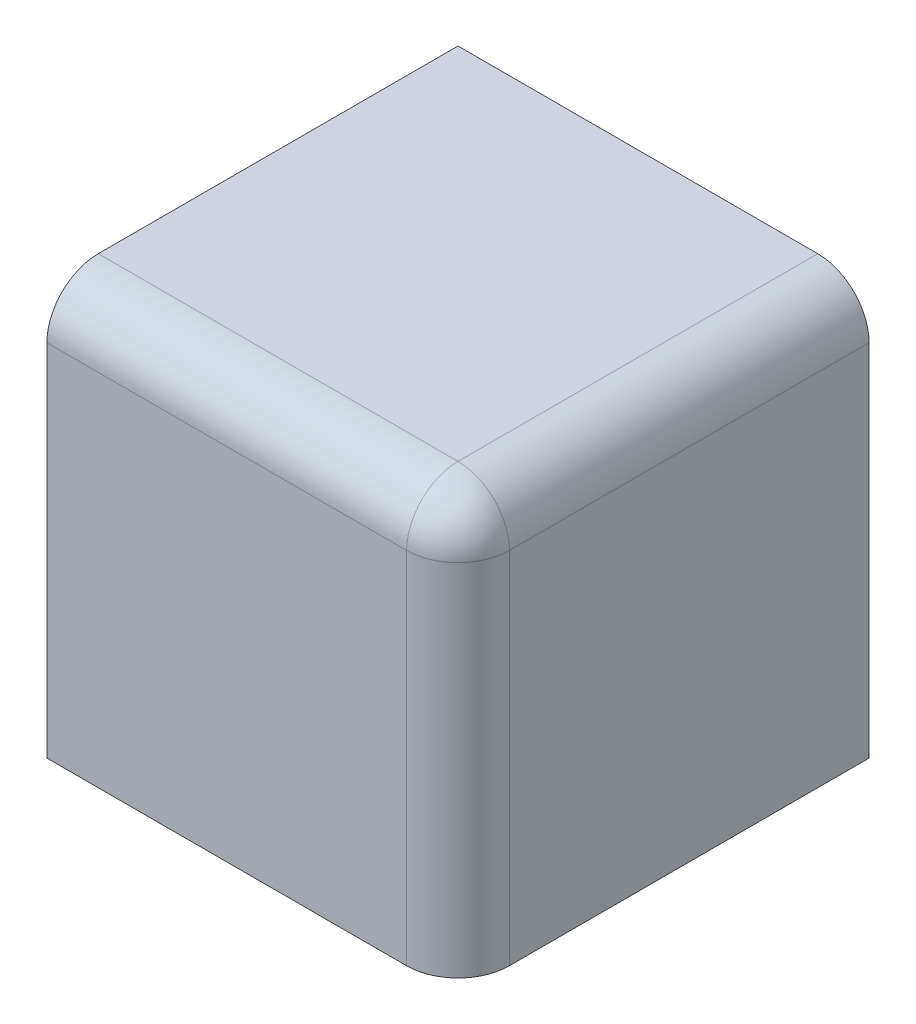
ISO-10303-21;
HEADER;
FILE_DESCRIPTION(('STEP AP214'),'2;1');
FILE_NAME('part.step','',(''),(''),'','','');
FILE_SCHEMA(('AUTOMOTIVE_DESIGN { 1 0 10303 214 1 1 1 1 }'));
ENDSEC;
DATA;
#1=APPLICATION_CONTEXT('core data for automotive mechanical design processes');
#2=APPLICATION_PROTOCOL_DEFINITION('international standard','automotive_design',2000,#1);
#3=PRODUCT_CONTEXT('',#1,'mechanical');
#4=PRODUCT('Part','Part','',(#3));
#5=PRODUCT_RELATED_PRODUCT_CATEGORY('part','',(#4));
#6=PRODUCT_DEFINITION_FORMATION('','',#4);
#7=PRODUCT_DEFINITION_CONTEXT('part definition',#1,'design');
#8=PRODUCT_DEFINITION('design','',#6,#7);
#9=PRODUCT_DEFINITION_SHAPE('','',#8);
#10=(LENGTH_UNIT() NAMED_UNIT(*) SI_UNIT(.MILLI.,.METRE.));
#11=(NAMED_UNIT(*) PLANE_ANGLE_UNIT() SI_UNIT($,.RADIAN.));
#12=(NAMED_UNIT(*) SI_UNIT($,.STERADIAN.) SOLID_ANGLE_UNIT());
#13=UNCERTAINTY_MEASURE_WITH_UNIT(LENGTH_MEASURE(1.E-05),#10,'distance_accuracy_value','');
#14=(GEOMETRIC_REPRESENTATION_CONTEXT(3) GLOBAL_UNCERTAINTY_ASSIGNED_CONTEXT((#13)) GLOBAL_UNIT_ASSIGNED_CONTEXT((#10,
#11,#12)) REPRESENTATION_CONTEXT('',''));
#15=CARTESIAN_POINT('',(0.,0.,0.));
#16=DIRECTION('',(0.,0.,1.));
#17=DIRECTION('',(1.,0.,0.));
#18=AXIS2_PLACEMENT_3D('',#15,#16,#17);
#19=CARTESIAN_POINT('',(0.,0.,20.));
#20=DIRECTION('',(0.,0.,1.));
#21=DIRECTION('',(1.,0.,0.));
#22=AXIS2_PLACEMENT_3D('',#19,#20,#21);
#23=PLANE('',#22);
#24=DIRECTION('',(0.,1.,0.));
#25=VECTOR('',#24,1.);
#26=CARTESIAN_POINT('',(17.5,0.,20.));
#27=LINE('',#26,#25);
#28=CARTESIAN_POINT('',(17.5,0.,20.));
#29=VERTEX_POINT('',#28);
#30=CARTESIAN_POINT('',(17.5,17.5,20.));
#31=VERTEX_POINT('',#30);
#32=EDGE_CURVE('E49',#29,#31,#27,.T.);
#33=ORIENTED_EDGE('',*,*,#32,.T.);
#34=DIRECTION('',(1.,0.,0.));
#35=VECTOR('',#34,1.);
#36=CARTESIAN_POINT('',(0.,17.5,20.));
#37=LINE('',#36,#35);
#38=CARTESIAN_POINT('',(0.,17.5,20.));
#39=VERTEX_POINT('',#38);
#40=EDGE_CURVE('E165',#31,#39,#37,.F.);
#41=ORIENTED_EDGE('',*,*,#40,.T.);
#42=DIRECTION('',(0.,1.,0.));
#43=VECTOR('',#42,1.);
#44=CARTESIAN_POINT('',(0.,0.,20.));
#45=LINE('',#44,#43);
#46=CARTESIAN_POINT('',(0.,0.,20.));
#47=VERTEX_POINT('',#46);
#48=EDGE_CURVE('E149',#47,#39,#45,.T.);
#49=ORIENTED_EDGE('',*,*,#48,.F.);
#50=DIRECTION('',(1.,0.,0.));
#51=VECTOR('',#50,1.);
#52=CARTESIAN_POINT('',(0.,0.,20.));
#53=LINE('',#52,#51);
#54=EDGE_CURVE('E131',#47,#29,#53,.T.);
#55=ORIENTED_EDGE('',*,*,#54,.T.);
#56=EDGE_LOOP('',(#33,#41,#49,#55));
#57=FACE_BOUND('',#56,.T.);
#58=ADVANCED_FACE('F32',(#57),#23,.T.);
#59=CARTESIAN_POINT('',(0.,0.,0.));
#60=DIRECTION('',(-1.,0.,0.));
#61=DIRECTION('',(0.,0.,1.));
#62=AXIS2_PLACEMENT_3D('',#59,#60,#61);
#63=PLANE('',#62);
#64=ORIENTED_EDGE('',*,*,#48,.T.);
#65=CARTESIAN_POINT('',(0.,17.5,17.5));
#66=DIRECTION('',(-1.,0.,0.));
#67=DIRECTION('',(0.,0.,1.));
#68=AXIS2_PLACEMENT_3D('',#65,#66,#67);
#69=CIRCLE('',#68,2.5);
#70=CARTESIAN_POINT('',(0.,20.,17.5));
#71=VERTEX_POINT('',#70);
#72=EDGE_CURVE('E41',#39,#71,#69,.T.);
#73=ORIENTED_EDGE('',*,*,#72,.T.);
#74=DIRECTION('',(0.,0.,1.));
#75=VECTOR('',#74,1.);
#76=CARTESIAN_POINT('',(0.,20.,0.));
#77=LINE('',#76,#75);
#78=CARTESIAN_POINT('',(0.,20.,0.));
#79=VERTEX_POINT('',#78);
#80=EDGE_CURVE('E145',#79,#71,#77,.T.);
#81=ORIENTED_EDGE('',*,*,#80,.F.);
#82=DIRECTION('',(0.,1.,0.));
#83=VECTOR('',#82,1.);
#84=CARTESIAN_POINT('',(0.,0.,0.));
#85=LINE('',#84,#83);
#86=CARTESIAN_POINT('',(0.,17.5,0.));
#87=VERTEX_POINT('',#86);
#88=EDGE_CURVE('E136',#87,#79,#85,.T.);
#89=ORIENTED_EDGE('',*,*,#88,.F.);
#90=DIRECTION('',(0.,0.,-1.));
#91=VECTOR('',#90,1.);
#92=CARTESIAN_POINT('',(0.,17.5,17.5));
#93=LINE('',#92,#91);
#94=CARTESIAN_POINT('',(0.,17.5,17.5));
#95=VERTEX_POINT('',#94);
#96=EDGE_CURVE('E127',#95,#87,#93,.T.);
#97=ORIENTED_EDGE('',*,*,#96,.F.);
#98=DIRECTION('',(0.,1.,0.));
#99=VECTOR('',#98,1.);
#100=CARTESIAN_POINT('',(0.,0.,17.5));
#101=LINE('',#100,#99);
#102=CARTESIAN_POINT('',(0.,0.,17.5));
#103=VERTEX_POINT('',#102);
#104=EDGE_CURVE('E112',#103,#95,#101,.T.);
#105=ORIENTED_EDGE('',*,*,#104,.F.);
#106=DIRECTION('',(0.,0.,1.));
#107=VECTOR('',#106,1.);
#108=CARTESIAN_POINT('',(0.,0.,0.));
#109=LINE('',#108,#107);
#110=EDGE_CURVE('E124',#103,#47,#109,.T.);
#111=ORIENTED_EDGE('',*,*,#110,.T.);
#112=EDGE_LOOP('',(#64,#73,#81,#89,#97,#105,#111));
#113=FACE_BOUND('',#112,.T.);
#114=ADVANCED_FACE('F123',(#113),#63,.T.);
#115=CARTESIAN_POINT('',(20.,0.,0.));
#116=DIRECTION('',(0.,0.,-1.));
#117=DIRECTION('',(-1.,0.,0.));
#118=AXIS2_PLACEMENT_3D('',#115,#116,#117);
#119=PLANE('',#118);
#120=DIRECTION('',(-1.,0.,0.));
#121=VECTOR('',#120,1.);
#122=CARTESIAN_POINT('',(20.,20.,0.));
#123=LINE('',#122,#121);
#124=CARTESIAN_POINT('',(17.5,20.,0.));
#125=VERTEX_POINT('',#124);
#126=EDGE_CURVE('E143',#125,#79,#123,.T.);
#127=ORIENTED_EDGE('',*,*,#126,.F.);
#128=CARTESIAN_POINT('',(17.5,17.5,0.));
#129=DIRECTION('',(0.,0.,-1.));
#130=DIRECTION('',(-1.,0.,0.));
#131=AXIS2_PLACEMENT_3D('',#128,#129,#130);
#132=CIRCLE('',#131,2.5);
#133=CARTESIAN_POINT('',(20.,17.5,0.));
#134=VERTEX_POINT('',#133);
#135=EDGE_CURVE('E158',#125,#134,#132,.T.);
#136=ORIENTED_EDGE('',*,*,#135,.T.);
#137=DIRECTION('',(0.,1.,0.));
#138=VECTOR('',#137,1.);
#139=CARTESIAN_POINT('',(20.,0.,0.));
#140=LINE('',#139,#138);
#141=CARTESIAN_POINT('',(20.,0.,0.));
#142=VERTEX_POINT('',#141);
#143=EDGE_CURVE('E132',#142,#134,#140,.T.);
#144=ORIENTED_EDGE('',*,*,#143,.F.);
#145=DIRECTION('',(-1.,0.,0.));
#146=VECTOR('',#145,1.);
#147=CARTESIAN_POINT('',(20.,0.,0.));
#148=LINE('',#147,#146);
#149=CARTESIAN_POINT('',(17.5,0.,0.));
#150=VERTEX_POINT('',#149);
#151=EDGE_CURVE('E133',#142,#150,#148,.T.);
#152=ORIENTED_EDGE('',*,*,#151,.T.);
#153=DIRECTION('',(0.,-1.,0.));
#154=VECTOR('',#153,1.);
#155=CARTESIAN_POINT('',(17.5,17.5,0.));
#156=LINE('',#155,#154);
#157=CARTESIAN_POINT('',(17.5,17.5,0.));
#158=VERTEX_POINT('',#157);
#159=EDGE_CURVE('E119',#158,#150,#156,.T.);
#160=ORIENTED_EDGE('',*,*,#159,.F.);
#161=DIRECTION('',(1.,0.,0.));
#162=VECTOR('',#161,1.);
#163=CARTESIAN_POINT('',(0.,17.5,0.));
#164=LINE('',#163,#162);
#165=EDGE_CURVE('E176',#87,#158,#164,.T.);
#166=ORIENTED_EDGE('',*,*,#165,.F.);
#167=ORIENTED_EDGE('',*,*,#88,.T.);
#168=EDGE_LOOP('',(#127,#136,#144,#152,#160,#166,#167));
#169=FACE_BOUND('',#168,.T.);
#170=ADVANCED_FACE('F199',(#169),#119,.T.);
#171=CARTESIAN_POINT('',(20.,0.,20.));
#172=DIRECTION('',(1.,0.,0.));
#173=DIRECTION('',(0.,0.,-1.));
#174=AXIS2_PLACEMENT_3D('',#171,#172,#173);
#175=PLANE('',#174);
#176=ORIENTED_EDGE('',*,*,#143,.T.);
#177=DIRECTION('',(0.,0.,-1.));
#178=VECTOR('',#177,1.);
#179=CARTESIAN_POINT('',(20.,17.5,20.));
#180=LINE('',#179,#178);
#181=CARTESIAN_POINT('',(20.,17.5,17.5));
#182=VERTEX_POINT('',#181);
#183=EDGE_CURVE('E162',#134,#182,#180,.F.);
#184=ORIENTED_EDGE('',*,*,#183,.T.);
#185=DIRECTION('',(0.,1.,0.));
#186=VECTOR('',#185,1.);
#187=CARTESIAN_POINT('',(20.,0.,17.5));
#188=LINE('',#187,#186);
#189=CARTESIAN_POINT('',(20.,0.,17.5));
#190=VERTEX_POINT('',#189);
#191=EDGE_CURVE('E160',#182,#190,#188,.F.);
#192=ORIENTED_EDGE('',*,*,#191,.T.);
#193=DIRECTION('',(0.,0.,-1.));
#194=VECTOR('',#193,1.);
#195=CARTESIAN_POINT('',(20.,0.,20.));
#196=LINE('',#195,#194);
#197=EDGE_CURVE('E139',#190,#142,#196,.T.);
#198=ORIENTED_EDGE('',*,*,#197,.T.);
#199=EDGE_LOOP('',(#176,#184,#192,#198));
#200=FACE_BOUND('',#199,.T.);
#201=ADVANCED_FACE('F193',(#200),#175,.T.);
#202=CARTESIAN_POINT('',(0.,0.,0.));
#203=DIRECTION('',(0.,1.,0.));
#204=DIRECTION('',(0.,0.,1.));
#205=AXIS2_PLACEMENT_3D('',#202,#203,#204);
#206=PLANE('',#205);
#207=ORIENTED_EDGE('',*,*,#197,.F.);
#208=CARTESIAN_POINT('',(17.5,0.,17.5));
#209=DIRECTION('',(0.,1.,0.));
#210=DIRECTION('',(0.,0.,1.));
#211=AXIS2_PLACEMENT_3D('',#208,#209,#210);
#212=CIRCLE('',#211,2.5);
#213=EDGE_CURVE('E11',#190,#29,#212,.F.);
#214=ORIENTED_EDGE('',*,*,#213,.T.);
#215=ORIENTED_EDGE('',*,*,#54,.F.);
#216=ORIENTED_EDGE('',*,*,#110,.F.);
#217=DIRECTION('',(-1.,0.,0.));
#218=VECTOR('',#217,1.);
#219=CARTESIAN_POINT('',(17.5,0.,17.5));
#220=LINE('',#219,#218);
#221=CARTESIAN_POINT('',(17.5,0.,17.5));
#222=VERTEX_POINT('',#221);
#223=EDGE_CURVE('E108',#222,#103,#220,.T.);
#224=ORIENTED_EDGE('',*,*,#223,.F.);
#225=DIRECTION('',(0.,0.,-1.));
#226=VECTOR('',#225,1.);
#227=CARTESIAN_POINT('',(17.5,0.,17.5));
#228=LINE('',#227,#226);
#229=EDGE_CURVE('E146',#222,#150,#228,.T.);
#230=ORIENTED_EDGE('',*,*,#229,.T.);
#231=ORIENTED_EDGE('',*,*,#151,.F.);
#232=EDGE_LOOP('',(#207,#214,#215,#216,#224,#230,#231));
#233=FACE_BOUND('',#232,.T.);
#234=ADVANCED_FACE('F130',(#233),#206,.F.);
#235=CARTESIAN_POINT('',(0.,20.,0.));
#236=DIRECTION('',(0.,1.,0.));
#237=DIRECTION('',(0.,0.,1.));
#238=AXIS2_PLACEMENT_3D('',#235,#236,#237);
#239=PLANE('',#238);
#240=DIRECTION('',(1.,0.,0.));
#241=VECTOR('',#240,1.);
#242=CARTESIAN_POINT('',(0.,20.,17.5));
#243=LINE('',#242,#241);
#244=CARTESIAN_POINT('',(17.5,20.,17.5));
#245=VERTEX_POINT('',#244);
#246=EDGE_CURVE('E151',#71,#245,#243,.T.);
#247=ORIENTED_EDGE('',*,*,#246,.T.);
#248=DIRECTION('',(0.,0.,-1.));
#249=VECTOR('',#248,1.);
#250=CARTESIAN_POINT('',(17.5,20.,0.));
#251=LINE('',#250,#249);
#252=EDGE_CURVE('E155',#245,#125,#251,.T.);
#253=ORIENTED_EDGE('',*,*,#252,.T.);
#254=ORIENTED_EDGE('',*,*,#126,.T.);
#255=ORIENTED_EDGE('',*,*,#80,.T.);
#256=EDGE_LOOP('',(#247,#253,#254,#255));
#257=FACE_BOUND('',#256,.T.);
#258=ADVANCED_FACE('F206',(#257),#239,.T.);
#259=CARTESIAN_POINT('',(17.5,17.5,17.5));
#260=DIRECTION('',(1.,0.,0.));
#261=DIRECTION('',(0.,0.,-1.));
#262=AXIS2_PLACEMENT_3D('',#259,#260,#261);
#263=PLANE('',#262);
#264=ORIENTED_EDGE('',*,*,#159,.T.);
#265=ORIENTED_EDGE('',*,*,#229,.F.);
#266=DIRECTION('',(0.,-1.,0.));
#267=VECTOR('',#266,1.);
#268=CARTESIAN_POINT('',(17.5,17.5,17.5));
#269=LINE('',#268,#267);
#270=CARTESIAN_POINT('',(17.5,17.5,17.5));
#271=VERTEX_POINT('',#270);
#272=EDGE_CURVE('E115',#271,#222,#269,.T.);
#273=ORIENTED_EDGE('',*,*,#272,.F.);
#274=DIRECTION('',(0.,0.,-1.));
#275=VECTOR('',#274,1.);
#276=CARTESIAN_POINT('',(17.5,17.5,17.5));
#277=LINE('',#276,#275);
#278=EDGE_CURVE('E188',#271,#158,#277,.T.);
#279=ORIENTED_EDGE('',*,*,#278,.T.);
#280=EDGE_LOOP('',(#264,#265,#273,#279));
#281=FACE_BOUND('',#280,.T.);
#282=ADVANCED_FACE('F201',(#281),#263,.F.);
#283=CARTESIAN_POINT('',(0.,17.5,17.5));
#284=DIRECTION('',(0.,1.,0.));
#285=DIRECTION('',(0.,0.,1.));
#286=AXIS2_PLACEMENT_3D('',#283,#284,#285);
#287=PLANE('',#286);
#288=ORIENTED_EDGE('',*,*,#165,.T.);
#289=ORIENTED_EDGE('',*,*,#278,.F.);
#290=DIRECTION('',(1.,0.,0.));
#291=VECTOR('',#290,1.);
#292=CARTESIAN_POINT('',(0.,17.5,17.5));
#293=LINE('',#292,#291);
#294=EDGE_CURVE('E128',#95,#271,#293,.T.);
#295=ORIENTED_EDGE('',*,*,#294,.F.);
#296=ORIENTED_EDGE('',*,*,#96,.T.);
#297=EDGE_LOOP('',(#288,#289,#295,#296));
#298=FACE_BOUND('',#297,.T.);
#299=ADVANCED_FACE('F219',(#298),#287,.F.);
#300=CARTESIAN_POINT('',(0.,0.,17.5));
#301=DIRECTION('',(0.,0.,-1.));
#302=DIRECTION('',(-1.,0.,0.));
#303=AXIS2_PLACEMENT_3D('',#300,#301,#302);
#304=PLANE('',#303);
#305=ORIENTED_EDGE('',*,*,#223,.T.);
#306=ORIENTED_EDGE('',*,*,#104,.T.);
#307=ORIENTED_EDGE('',*,*,#294,.T.);
#308=ORIENTED_EDGE('',*,*,#272,.T.);
#309=EDGE_LOOP('',(#305,#306,#307,#308));
#310=FACE_BOUND('',#309,.T.);
#311=ADVANCED_FACE('F110',(#310),#304,.T.);
#312=CARTESIAN_POINT('',(17.5,0.,17.5));
#313=DIRECTION('',(0.,1.,0.));
#314=DIRECTION('',(0.,0.,1.));
#315=AXIS2_PLACEMENT_3D('',#312,#313,#314);
#316=CYLINDRICAL_SURFACE('',#315,2.5);
#317=ORIENTED_EDGE('',*,*,#213,.F.);
#318=ORIENTED_EDGE('',*,*,#191,.F.);
#319=CARTESIAN_POINT('',(17.5,17.5,17.5));
#320=DIRECTION('',(0.,1.,0.));
#321=DIRECTION('',(0.,0.,1.));
#322=AXIS2_PLACEMENT_3D('',#319,#320,#321);
#323=CIRCLE('',#322,2.5);
#324=EDGE_CURVE('E36',#31,#182,#323,.T.);
#325=ORIENTED_EDGE('',*,*,#324,.F.);
#326=ORIENTED_EDGE('',*,*,#32,.F.);
#327=EDGE_LOOP('',(#317,#318,#325,#326));
#328=FACE_BOUND('',#327,.T.);
#329=ADVANCED_FACE('F34',(#328),#316,.T.);
#330=CARTESIAN_POINT('',(0.,17.5,17.5));
#331=DIRECTION('',(1.,0.,0.));
#332=DIRECTION('',(0.,0.,-1.));
#333=AXIS2_PLACEMENT_3D('',#330,#331,#332);
#334=CYLINDRICAL_SURFACE('',#333,2.5);
#335=ORIENTED_EDGE('',*,*,#72,.F.);
#336=ORIENTED_EDGE('',*,*,#40,.F.);
#337=CARTESIAN_POINT('',(17.5,17.5,17.5));
#338=DIRECTION('',(1.,0.,0.));
#339=DIRECTION('',(0.,0.,-1.));
#340=AXIS2_PLACEMENT_3D('',#337,#338,#339);
#341=CIRCLE('',#340,2.5);
#342=EDGE_CURVE('E170',#245,#31,#341,.T.);
#343=ORIENTED_EDGE('',*,*,#342,.F.);
#344=ORIENTED_EDGE('',*,*,#246,.F.);
#345=EDGE_LOOP('',(#335,#336,#343,#344));
#346=FACE_BOUND('',#345,.T.);
#347=ADVANCED_FACE('F208',(#346),#334,.T.);
#348=CARTESIAN_POINT('',(17.5,17.5,17.5));
#349=DIRECTION('',(0.,0.,1.));
#350=DIRECTION('',(1.,0.,0.));
#351=AXIS2_PLACEMENT_3D('',#348,#349,#350);
#352=SPHERICAL_SURFACE('',#351,2.5);
#353=ORIENTED_EDGE('',*,*,#342,.T.);
#354=ORIENTED_EDGE('',*,*,#324,.T.);
#355=CARTESIAN_POINT('',(17.5,17.5,17.5));
#356=DIRECTION('',(0.,0.,1.));
#357=DIRECTION('',(1.,0.,0.));
#358=AXIS2_PLACEMENT_3D('',#355,#356,#357);
#359=CIRCLE('',#358,2.5);
#360=EDGE_CURVE('E168',#245,#182,#359,.F.);
#361=ORIENTED_EDGE('',*,*,#360,.F.);
#362=EDGE_LOOP('',(#353,#354,#361));
#363=FACE_BOUND('',#362,.T.);
#364=ADVANCED_FACE('F210',(#363),#352,.T.);
#365=CARTESIAN_POINT('',(17.5,17.5,0.));
#366=DIRECTION('',(0.,0.,-1.));
#367=DIRECTION('',(-1.,0.,0.));
#368=AXIS2_PLACEMENT_3D('',#365,#366,#367);
#369=CYLINDRICAL_SURFACE('',#368,2.5);
#370=ORIENTED_EDGE('',*,*,#360,.T.);
#371=ORIENTED_EDGE('',*,*,#183,.F.);
#372=ORIENTED_EDGE('',*,*,#135,.F.);
#373=ORIENTED_EDGE('',*,*,#252,.F.);
#374=EDGE_LOOP('',(#370,#371,#372,#373));
#375=FACE_BOUND('',#374,.T.);
#376=ADVANCED_FACE('F212',(#375),#369,.T.);
#377=CLOSED_SHELL('',(#58,#114,#170,#201,#234,#258,#282,#299,#311,#329,#347,#364,#376));
#378=MANIFOLD_SOLID_BREP('B2',#377);
#379=ADVANCED_BREP_SHAPE_REPRESENTATION('',(#18,#378),#14);
#380=SHAPE_DEFINITION_REPRESENTATION(#9,#379);
ENDSEC;
END-ISO-10303-21;
